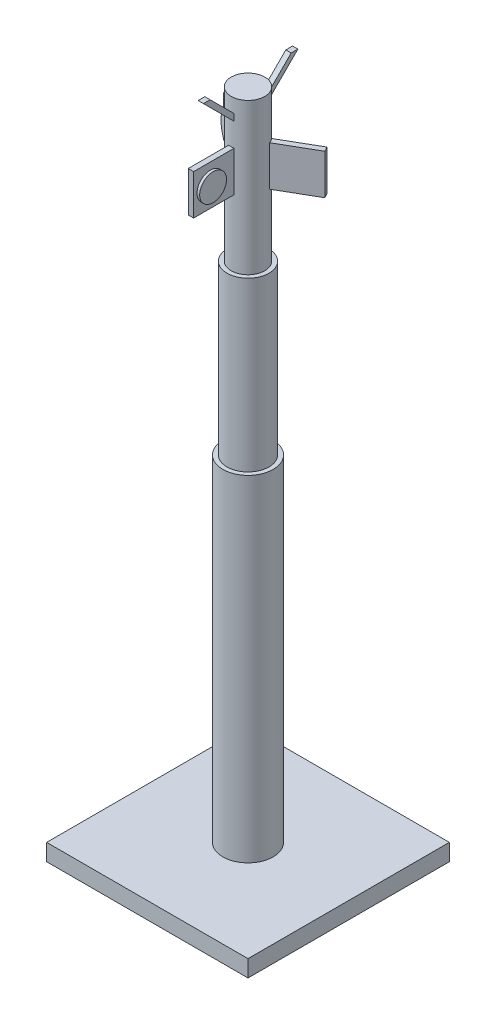
ISO-10303-21;
HEADER;
FILE_DESCRIPTION(('STEP AP214'),'2;1');
FILE_NAME('part.step','',(''),(''),'','','');
FILE_SCHEMA(('AUTOMOTIVE_DESIGN { 1 0 10303 214 1 1 1 1 }'));
ENDSEC;
DATA;
#1=APPLICATION_CONTEXT('core data for automotive mechanical design processes');
#2=APPLICATION_PROTOCOL_DEFINITION('international standard','automotive_design',2000,#1);
#3=PRODUCT_CONTEXT('',#1,'mechanical');
#4=PRODUCT('Part','Part','',(#3));
#5=PRODUCT_RELATED_PRODUCT_CATEGORY('part','',(#4));
#6=PRODUCT_DEFINITION_FORMATION('','',#4);
#7=PRODUCT_DEFINITION_CONTEXT('part definition',#1,'design');
#8=PRODUCT_DEFINITION('design','',#6,#7);
#9=PRODUCT_DEFINITION_SHAPE('','',#8);
#10=(LENGTH_UNIT() NAMED_UNIT(*) SI_UNIT(.MILLI.,.METRE.));
#11=(NAMED_UNIT(*) PLANE_ANGLE_UNIT() SI_UNIT($,.RADIAN.));
#12=(NAMED_UNIT(*) SI_UNIT($,.STERADIAN.) SOLID_ANGLE_UNIT());
#13=UNCERTAINTY_MEASURE_WITH_UNIT(LENGTH_MEASURE(1.E-05),#10,'distance_accuracy_value','');
#14=(GEOMETRIC_REPRESENTATION_CONTEXT(3) GLOBAL_UNCERTAINTY_ASSIGNED_CONTEXT((#13)) GLOBAL_UNIT_ASSIGNED_CONTEXT((#10,
#11,#12)) REPRESENTATION_CONTEXT('',''));
#15=CARTESIAN_POINT('',(0.,0.,0.));
#16=DIRECTION('',(0.,0.,1.));
#17=DIRECTION('',(1.,0.,0.));
#18=AXIS2_PLACEMENT_3D('',#15,#16,#17);
#19=CARTESIAN_POINT('',(-0.8,186.622477316981,0.622477316980994));
#20=DIRECTION('',(0.,0.707106781186553,0.707106781186542));
#21=DIRECTION('',(0.,-0.707106781186542,0.707106781186553));
#22=AXIS2_PLACEMENT_3D('',#19,#20,#21);
#23=PLANE('',#22);
#24=DIRECTION('',(1.,0.,0.));
#25=VECTOR('',#24,1.);
#26=CARTESIAN_POINT('',(-0.8,186.622477316981,0.622477316980994));
#27=LINE('',#26,#25);
#28=CARTESIAN_POINT('',(-0.8,186.622477316981,0.622477316980994));
#29=VERTEX_POINT('',#28);
#30=CARTESIAN_POINT('',(0.8,186.622477316981,0.622477316980994));
#31=VERTEX_POINT('',#30);
#32=EDGE_CURVE('E66',#29,#31,#27,.T.);
#33=ORIENTED_EDGE('',*,*,#32,.T.);
#34=DIRECTION('',(0.,-0.707106781186542,0.707106781186553));
#35=VECTOR('',#34,1.);
#36=CARTESIAN_POINT('',(0.8,186.622477316981,0.622477316980994));
#37=LINE('',#36,#35);
#38=CARTESIAN_POINT('',(0.8,185.622477316981,1.62247731698098));
#39=VERTEX_POINT('',#38);
#40=EDGE_CURVE('E59',#31,#39,#37,.T.);
#41=ORIENTED_EDGE('',*,*,#40,.T.);
#42=DIRECTION('',(1.,0.,0.));
#43=VECTOR('',#42,1.);
#44=CARTESIAN_POINT('',(-0.8,185.622477316981,1.62247731698098));
#45=LINE('',#44,#43);
#46=CARTESIAN_POINT('',(-0.8,185.622477316981,1.62247731698098));
#47=VERTEX_POINT('',#46);
#48=EDGE_CURVE('E74',#47,#39,#45,.T.);
#49=ORIENTED_EDGE('',*,*,#48,.F.);
#50=DIRECTION('',(0.,-0.707106781186542,0.707106781186553));
#51=VECTOR('',#50,1.);
#52=CARTESIAN_POINT('',(-0.8,186.622477316981,0.622477316980994));
#53=LINE('',#52,#51);
#54=EDGE_CURVE('E102',#29,#47,#53,.T.);
#55=ORIENTED_EDGE('',*,*,#54,.F.);
#56=EDGE_LOOP('',(#33,#41,#49,#55));
#57=FACE_BOUND('',#56,.T.);
#58=ADVANCED_FACE('F51',(#57),#23,.F.);
#59=CARTESIAN_POINT('',(-0.8,198.071067811866,14.0710678118654));
#60=DIRECTION('',(0.,-0.707106781186545,0.707106781186551));
#61=DIRECTION('',(0.,-0.707106781186551,-0.707106781186545));
#62=AXIS2_PLACEMENT_3D('',#59,#60,#61);
#63=PLANE('',#62);
#64=ORIENTED_EDGE('',*,*,#48,.T.);
#65=DIRECTION('',(0.,-0.707106781186551,-0.707106781186544));
#66=VECTOR('',#65,1.);
#67=CARTESIAN_POINT('',(0.8,189.,5.));
#68=LINE('',#67,#66);
#69=CARTESIAN_POINT('',(0.8,198.071067811866,14.0710678118654));
#70=VERTEX_POINT('',#69);
#71=EDGE_CURVE('E121',#70,#39,#68,.T.);
#72=ORIENTED_EDGE('',*,*,#71,.F.);
#73=DIRECTION('',(1.,0.,0.));
#74=VECTOR('',#73,1.);
#75=CARTESIAN_POINT('',(-0.8,198.071067811866,14.0710678118654));
#76=LINE('',#75,#74);
#77=CARTESIAN_POINT('',(-0.8,198.071067811866,14.0710678118654));
#78=VERTEX_POINT('',#77);
#79=EDGE_CURVE('E110',#78,#70,#76,.T.);
#80=ORIENTED_EDGE('',*,*,#79,.F.);
#81=DIRECTION('',(0.,-0.707106781186551,-0.707106781186544));
#82=VECTOR('',#81,1.);
#83=CARTESIAN_POINT('',(-0.8,189.,5.));
#84=LINE('',#83,#82);
#85=EDGE_CURVE('E113',#78,#47,#84,.T.);
#86=ORIENTED_EDGE('',*,*,#85,.T.);
#87=EDGE_LOOP('',(#64,#72,#80,#86));
#88=FACE_BOUND('',#87,.T.);
#89=ADVANCED_FACE('F123',(#88),#63,.T.);
#90=CARTESIAN_POINT('',(-0.8,198.071067811866,12.0710678118654));
#91=DIRECTION('',(0.,1.,0.));
#92=DIRECTION('',(0.,0.,1.));
#93=AXIS2_PLACEMENT_3D('',#90,#91,#92);
#94=PLANE('',#93);
#95=ORIENTED_EDGE('',*,*,#79,.T.);
#96=DIRECTION('',(0.,0.,1.));
#97=VECTOR('',#96,1.);
#98=CARTESIAN_POINT('',(0.8,198.071067811866,12.0710678118654));
#99=LINE('',#98,#97);
#100=CARTESIAN_POINT('',(0.8,198.071067811866,12.0710678118654));
#101=VERTEX_POINT('',#100);
#102=EDGE_CURVE('E101',#101,#70,#99,.T.);
#103=ORIENTED_EDGE('',*,*,#102,.F.);
#104=DIRECTION('',(1.,0.,0.));
#105=VECTOR('',#104,1.);
#106=CARTESIAN_POINT('',(-0.8,198.071067811866,12.0710678118654));
#107=LINE('',#106,#105);
#108=CARTESIAN_POINT('',(-0.8,198.071067811866,12.0710678118654));
#109=VERTEX_POINT('',#108);
#110=EDGE_CURVE('E97',#109,#101,#107,.T.);
#111=ORIENTED_EDGE('',*,*,#110,.F.);
#112=DIRECTION('',(0.,0.,1.));
#113=VECTOR('',#112,1.);
#114=CARTESIAN_POINT('',(-0.8,198.071067811866,12.0710678118654));
#115=LINE('',#114,#113);
#116=EDGE_CURVE('E108',#109,#78,#115,.T.);
#117=ORIENTED_EDGE('',*,*,#116,.T.);
#118=EDGE_LOOP('',(#95,#103,#111,#117));
#119=FACE_BOUND('',#118,.T.);
#120=ADVANCED_FACE('F107',(#119),#94,.T.);
#121=CARTESIAN_POINT('',(-0.8,191.,5.));
#122=DIRECTION('',(0.,0.707106781186543,-0.707106781186551));
#123=DIRECTION('',(0.,0.707106781186552,0.707106781186544));
#124=AXIS2_PLACEMENT_3D('',#121,#122,#123);
#125=PLANE('',#124);
#126=ORIENTED_EDGE('',*,*,#110,.T.);
#127=DIRECTION('',(0.,-0.707106781186551,-0.707106781186544));
#128=VECTOR('',#127,1.);
#129=CARTESIAN_POINT('',(0.8,191.,5.));
#130=LINE('',#129,#128);
#131=EDGE_CURVE('E12',#101,#31,#130,.T.);
#132=ORIENTED_EDGE('',*,*,#131,.T.);
#133=ORIENTED_EDGE('',*,*,#32,.F.);
#134=DIRECTION('',(0.,-0.707106781186551,-0.707106781186544));
#135=VECTOR('',#134,1.);
#136=CARTESIAN_POINT('',(-0.8,191.,5.));
#137=LINE('',#136,#135);
#138=EDGE_CURVE('E94',#109,#29,#137,.T.);
#139=ORIENTED_EDGE('',*,*,#138,.F.);
#140=EDGE_LOOP('',(#126,#132,#133,#139));
#141=FACE_BOUND('',#140,.T.);
#142=ADVANCED_FACE('F96',(#141),#125,.T.);
#143=CARTESIAN_POINT('',(-0.8,0.,0.));
#144=DIRECTION('',(-1.,0.,0.));
#145=DIRECTION('',(0.,0.,1.));
#146=AXIS2_PLACEMENT_3D('',#143,#144,#145);
#147=PLANE('',#146);
#148=ORIENTED_EDGE('',*,*,#138,.T.);
#149=ORIENTED_EDGE('',*,*,#54,.T.);
#150=ORIENTED_EDGE('',*,*,#85,.F.);
#151=ORIENTED_EDGE('',*,*,#116,.F.);
#152=EDGE_LOOP('',(#148,#149,#150,#151));
#153=FACE_BOUND('',#152,.T.);
#154=ADVANCED_FACE('F112',(#153),#147,.T.);
#155=CARTESIAN_POINT('',(0.8,0.,0.));
#156=DIRECTION('',(-1.,0.,0.));
#157=DIRECTION('',(0.,0.,1.));
#158=AXIS2_PLACEMENT_3D('',#155,#156,#157);
#159=PLANE('',#158);
#160=ORIENTED_EDGE('',*,*,#131,.F.);
#161=ORIENTED_EDGE('',*,*,#102,.T.);
#162=ORIENTED_EDGE('',*,*,#71,.T.);
#163=ORIENTED_EDGE('',*,*,#40,.F.);
#164=EDGE_LOOP('',(#160,#161,#162,#163));
#165=FACE_BOUND('',#164,.T.);
#166=ADVANCED_FACE('F53',(#165),#159,.F.);
#167=CLOSED_SHELL('',(#58,#89,#120,#142,#154,#166));
#168=MANIFOLD_SOLID_BREP('B2',#167);
#169=CARTESIAN_POINT('',(-0.8,191.,-5.));
#170=DIRECTION('',(0.,-0.707106781186546,-0.707106781186549));
#171=DIRECTION('',(0.,0.707106781186549,-0.707106781186546));
#172=AXIS2_PLACEMENT_3D('',#169,#170,#171);
#173=PLANE('',#172);
#174=DIRECTION('',(1.,0.,0.));
#175=VECTOR('',#174,1.);
#176=CARTESIAN_POINT('',(-0.8,186.622477316981,-0.622477316980986));
#177=LINE('',#176,#175);
#178=CARTESIAN_POINT('',(-0.8,186.622477316981,-0.622477316980986));
#179=VERTEX_POINT('',#178);
#180=CARTESIAN_POINT('',(0.8,186.622477316981,-0.622477316980986));
#181=VERTEX_POINT('',#180);
#182=EDGE_CURVE('E205',#179,#181,#177,.T.);
#183=ORIENTED_EDGE('',*,*,#182,.T.);
#184=DIRECTION('',(0.,-0.70710678118655,0.707106781186545));
#185=VECTOR('',#184,1.);
#186=CARTESIAN_POINT('',(0.8,191.,-5.));
#187=LINE('',#186,#185);
#188=CARTESIAN_POINT('',(0.8,198.071067811866,-12.0710678118655));
#189=VERTEX_POINT('',#188);
#190=EDGE_CURVE('E245',#189,#181,#187,.T.);
#191=ORIENTED_EDGE('',*,*,#190,.F.);
#192=DIRECTION('',(1.,0.,0.));
#193=VECTOR('',#192,1.);
#194=CARTESIAN_POINT('',(-0.8,198.071067811866,-12.0710678118655));
#195=LINE('',#194,#193);
#196=CARTESIAN_POINT('',(-0.8,198.071067811866,-12.0710678118655));
#197=VERTEX_POINT('',#196);
#198=EDGE_CURVE('E49',#197,#189,#195,.T.);
#199=ORIENTED_EDGE('',*,*,#198,.F.);
#200=DIRECTION('',(0.,-0.70710678118655,0.707106781186545));
#201=VECTOR('',#200,1.);
#202=CARTESIAN_POINT('',(-0.8,191.,-5.));
#203=LINE('',#202,#201);
#204=EDGE_CURVE('E218',#197,#179,#203,.T.);
#205=ORIENTED_EDGE('',*,*,#204,.T.);
#206=EDGE_LOOP('',(#183,#191,#199,#205));
#207=FACE_BOUND('',#206,.T.);
#208=ADVANCED_FACE('F201',(#207),#173,.F.);
#209=CARTESIAN_POINT('',(-0.8,198.071067811866,-12.0710678118655));
#210=DIRECTION('',(0.,-1.,0.));
#211=DIRECTION('',(0.,0.,-1.));
#212=AXIS2_PLACEMENT_3D('',#209,#210,#211);
#213=PLANE('',#212);
#214=ORIENTED_EDGE('',*,*,#198,.T.);
#215=DIRECTION('',(0.,0.,-1.));
#216=VECTOR('',#215,1.);
#217=CARTESIAN_POINT('',(0.8,198.071067811866,-12.0710678118655));
#218=LINE('',#217,#216);
#219=CARTESIAN_POINT('',(0.8,198.071067811865,-14.0710678118655));
#220=VERTEX_POINT('',#219);
#221=EDGE_CURVE('E260',#189,#220,#218,.T.);
#222=ORIENTED_EDGE('',*,*,#221,.T.);
#223=DIRECTION('',(1.,0.,0.));
#224=VECTOR('',#223,1.);
#225=CARTESIAN_POINT('',(-0.8,198.071067811865,-14.0710678118655));
#226=LINE('',#225,#224);
#227=CARTESIAN_POINT('',(-0.8,198.071067811865,-14.0710678118655));
#228=VERTEX_POINT('',#227);
#229=EDGE_CURVE('E210',#228,#220,#226,.T.);
#230=ORIENTED_EDGE('',*,*,#229,.F.);
#231=DIRECTION('',(0.,0.,-1.));
#232=VECTOR('',#231,1.);
#233=CARTESIAN_POINT('',(-0.8,198.071067811866,-12.0710678118655));
#234=LINE('',#233,#232);
#235=EDGE_CURVE('E250',#197,#228,#234,.T.);
#236=ORIENTED_EDGE('',*,*,#235,.F.);
#237=EDGE_LOOP('',(#214,#222,#230,#236));
#238=FACE_BOUND('',#237,.T.);
#239=ADVANCED_FACE('F274',(#238),#213,.F.);
#240=CARTESIAN_POINT('',(-0.8,198.071067811865,-14.0710678118655));
#241=DIRECTION('',(0.,0.707106781186548,0.707106781186548));
#242=DIRECTION('',(0.,-0.707106781186548,0.707106781186548));
#243=AXIS2_PLACEMENT_3D('',#240,#241,#242);
#244=PLANE('',#243);
#245=ORIENTED_EDGE('',*,*,#229,.T.);
#246=DIRECTION('',(0.,-0.707106781186558,0.707106781186537));
#247=VECTOR('',#246,1.);
#248=CARTESIAN_POINT('',(0.8,189.,-5.));
#249=LINE('',#248,#247);
#250=CARTESIAN_POINT('',(0.8,185.622477316981,-1.62247731698102));
#251=VERTEX_POINT('',#250);
#252=EDGE_CURVE('E256',#220,#251,#249,.T.);
#253=ORIENTED_EDGE('',*,*,#252,.T.);
#254=DIRECTION('',(1.,0.,0.));
#255=VECTOR('',#254,1.);
#256=CARTESIAN_POINT('',(-0.8,185.622477316981,-1.62247731698102));
#257=LINE('',#256,#255);
#258=CARTESIAN_POINT('',(-0.8,185.622477316981,-1.62247731698102));
#259=VERTEX_POINT('',#258);
#260=EDGE_CURVE('E249',#259,#251,#257,.T.);
#261=ORIENTED_EDGE('',*,*,#260,.F.);
#262=DIRECTION('',(0.,-0.707106781186558,0.707106781186537));
#263=VECTOR('',#262,1.);
#264=CARTESIAN_POINT('',(-0.8,189.,-5.));
#265=LINE('',#264,#263);
#266=EDGE_CURVE('E226',#228,#259,#265,.T.);
#267=ORIENTED_EDGE('',*,*,#266,.F.);
#268=EDGE_LOOP('',(#245,#253,#261,#267));
#269=FACE_BOUND('',#268,.T.);
#270=ADVANCED_FACE('F271',(#269),#244,.F.);
#271=CARTESIAN_POINT('',(-0.8,186.622477316981,-0.622477316980986));
#272=DIRECTION('',(0.,-0.707106781186549,0.707106781186546));
#273=DIRECTION('',(0.,-0.707106781186546,-0.707106781186549));
#274=AXIS2_PLACEMENT_3D('',#271,#272,#273);
#275=PLANE('',#274);
#276=ORIENTED_EDGE('',*,*,#260,.T.);
#277=DIRECTION('',(0.,-0.707106781186546,-0.707106781186549));
#278=VECTOR('',#277,1.);
#279=CARTESIAN_POINT('',(0.8,186.622477316981,-0.622477316980986));
#280=LINE('',#279,#278);
#281=EDGE_CURVE('E252',#181,#251,#280,.T.);
#282=ORIENTED_EDGE('',*,*,#281,.F.);
#283=ORIENTED_EDGE('',*,*,#182,.F.);
#284=DIRECTION('',(0.,-0.707106781186546,-0.707106781186549));
#285=VECTOR('',#284,1.);
#286=CARTESIAN_POINT('',(-0.8,186.622477316981,-0.622477316980986));
#287=LINE('',#286,#285);
#288=EDGE_CURVE('E266',#179,#259,#287,.T.);
#289=ORIENTED_EDGE('',*,*,#288,.T.);
#290=EDGE_LOOP('',(#276,#282,#283,#289));
#291=FACE_BOUND('',#290,.T.);
#292=ADVANCED_FACE('F203',(#291),#275,.T.);
#293=CARTESIAN_POINT('',(-0.8,0.,0.));
#294=DIRECTION('',(1.,0.,0.));
#295=DIRECTION('',(0.,0.,-1.));
#296=AXIS2_PLACEMENT_3D('',#293,#294,#295);
#297=PLANE('',#296);
#298=ORIENTED_EDGE('',*,*,#204,.F.);
#299=ORIENTED_EDGE('',*,*,#235,.T.);
#300=ORIENTED_EDGE('',*,*,#266,.T.);
#301=ORIENTED_EDGE('',*,*,#288,.F.);
#302=EDGE_LOOP('',(#298,#299,#300,#301));
#303=FACE_BOUND('',#302,.T.);
#304=ADVANCED_FACE('F275',(#303),#297,.F.);
#305=CARTESIAN_POINT('',(0.8,0.,0.));
#306=DIRECTION('',(1.,0.,0.));
#307=DIRECTION('',(0.,0.,-1.));
#308=AXIS2_PLACEMENT_3D('',#305,#306,#307);
#309=PLANE('',#308);
#310=ORIENTED_EDGE('',*,*,#190,.T.);
#311=ORIENTED_EDGE('',*,*,#281,.T.);
#312=ORIENTED_EDGE('',*,*,#252,.F.);
#313=ORIENTED_EDGE('',*,*,#221,.F.);
#314=EDGE_LOOP('',(#310,#311,#312,#313));
#315=FACE_BOUND('',#314,.T.);
#316=ADVANCED_FACE('F258',(#315),#309,.T.);
#317=CLOSED_SHELL('',(#208,#239,#270,#292,#304,#316));
#318=MANIFOLD_SOLID_BREP('B6',#317);
#319=CARTESIAN_POINT('',(0.,100.,0.));
#320=DIRECTION('',(0.,-1.,0.));
#321=DIRECTION('',(0.,0.,-1.));
#322=AXIS2_PLACEMENT_3D('',#319,#320,#321);
#323=CYLINDRICAL_SURFACE('',#322,7.5);
#324=CARTESIAN_POINT('',(0.,100.,0.));
#325=DIRECTION('',(0.,1.,0.));
#326=DIRECTION('',(0.,0.,1.));
#327=AXIS2_PLACEMENT_3D('',#324,#325,#326);
#328=CIRCLE('',#327,7.5);
#329=CARTESIAN_POINT('',(0.,100.,7.5));
#330=VERTEX_POINT('',#329);
#331=EDGE_CURVE('E574',#330,#330,#328,.T.);
#332=ORIENTED_EDGE('',*,*,#331,.F.);
#333=EDGE_LOOP('',(#332));
#334=FACE_BOUND('',#333,.T.);
#335=CARTESIAN_POINT('',(0.,0.,0.));
#336=DIRECTION('',(0.,1.,0.));
#337=DIRECTION('',(0.,0.,1.));
#338=AXIS2_PLACEMENT_3D('',#335,#336,#337);
#339=CIRCLE('',#338,7.5);
#340=CARTESIAN_POINT('',(0.,0.,7.5));
#341=VERTEX_POINT('',#340);
#342=EDGE_CURVE('E570',#341,#341,#339,.T.);
#343=ORIENTED_EDGE('',*,*,#342,.T.);
#344=EDGE_LOOP('',(#343));
#345=FACE_BOUND('',#344,.T.);
#346=ADVANCED_FACE('F342',(#334,#345),#323,.T.);
#347=CARTESIAN_POINT('',(0.,100.,0.));
#348=DIRECTION('',(0.,1.,0.));
#349=DIRECTION('',(0.,0.,1.));
#350=AXIS2_PLACEMENT_3D('',#347,#348,#349);
#351=PLANE('',#350);
#352=CARTESIAN_POINT('',(0.,100.,0.));
#353=DIRECTION('',(0.,1.,0.));
#354=DIRECTION('',(0.,0.,1.));
#355=AXIS2_PLACEMENT_3D('',#352,#353,#354);
#356=CIRCLE('',#355,6.25);
#357=CARTESIAN_POINT('',(0.,100.,6.25));
#358=VERTEX_POINT('',#357);
#359=EDGE_CURVE('E540',#358,#358,#356,.T.);
#360=ORIENTED_EDGE('',*,*,#359,.F.);
#361=EDGE_LOOP('',(#360));
#362=FACE_BOUND('',#361,.T.);
#363=ORIENTED_EDGE('',*,*,#331,.T.);
#364=EDGE_LOOP('',(#363));
#365=FACE_BOUND('',#364,.T.);
#366=ADVANCED_FACE('F645',(#362,#365),#351,.T.);
#367=CARTESIAN_POINT('',(0.,150.,0.));
#368=DIRECTION('',(0.,-1.,0.));
#369=DIRECTION('',(0.,0.,-1.));
#370=AXIS2_PLACEMENT_3D('',#367,#368,#369);
#371=CYLINDRICAL_SURFACE('',#370,6.25);
#372=CARTESIAN_POINT('',(0.,150.,0.));
#373=DIRECTION('',(0.,1.,0.));
#374=DIRECTION('',(0.,0.,1.));
#375=AXIS2_PLACEMENT_3D('',#372,#373,#374);
#376=CIRCLE('',#375,6.25);
#377=CARTESIAN_POINT('',(0.,150.,6.25));
#378=VERTEX_POINT('',#377);
#379=EDGE_CURVE('E571',#378,#378,#376,.T.);
#380=ORIENTED_EDGE('',*,*,#379,.F.);
#381=EDGE_LOOP('',(#380));
#382=FACE_BOUND('',#381,.T.);
#383=ORIENTED_EDGE('',*,*,#359,.T.);
#384=EDGE_LOOP('',(#383));
#385=FACE_BOUND('',#384,.T.);
#386=ADVANCED_FACE('F650',(#382,#385),#371,.T.);
#387=CARTESIAN_POINT('',(0.,150.,0.));
#388=DIRECTION('',(0.,1.,0.));
#389=DIRECTION('',(0.,0.,1.));
#390=AXIS2_PLACEMENT_3D('',#387,#388,#389);
#391=PLANE('',#390);
#392=CARTESIAN_POINT('',(0.,150.,0.));
#393=DIRECTION('',(0.,1.,0.));
#394=DIRECTION('',(0.,0.,1.));
#395=AXIS2_PLACEMENT_3D('',#392,#393,#394);
#396=CIRCLE('',#395,5.);
#397=CARTESIAN_POINT('',(0.,150.,5.));
#398=VERTEX_POINT('',#397);
#399=EDGE_CURVE('E536',#398,#398,#396,.T.);
#400=ORIENTED_EDGE('',*,*,#399,.F.);
#401=EDGE_LOOP('',(#400));
#402=FACE_BOUND('',#401,.T.);
#403=ORIENTED_EDGE('',*,*,#379,.T.);
#404=EDGE_LOOP('',(#403));
#405=FACE_BOUND('',#404,.T.);
#406=ADVANCED_FACE('F695',(#402,#405),#391,.T.);
#407=CARTESIAN_POINT('',(30.,-5.,30.));
#408=DIRECTION('',(-1.,0.,0.));
#409=DIRECTION('',(0.,0.,1.));
#410=AXIS2_PLACEMENT_3D('',#407,#408,#409);
#411=PLANE('',#410);
#412=DIRECTION('',(0.,0.,1.));
#413=VECTOR('',#412,1.);
#414=CARTESIAN_POINT('',(30.,0.,30.));
#415=LINE('',#414,#413);
#416=CARTESIAN_POINT('',(30.,0.,-30.));
#417=VERTEX_POINT('',#416);
#418=CARTESIAN_POINT('',(30.,0.,30.));
#419=VERTEX_POINT('',#418);
#420=EDGE_CURVE('E535',#417,#419,#415,.T.);
#421=ORIENTED_EDGE('',*,*,#420,.T.);
#422=DIRECTION('',(0.,1.,0.));
#423=VECTOR('',#422,1.);
#424=CARTESIAN_POINT('',(30.,-5.,30.));
#425=LINE('',#424,#423);
#426=CARTESIAN_POINT('',(30.,-5.,30.));
#427=VERTEX_POINT('',#426);
#428=EDGE_CURVE('E567',#427,#419,#425,.T.);
#429=ORIENTED_EDGE('',*,*,#428,.F.);
#430=DIRECTION('',(0.,0.,1.));
#431=VECTOR('',#430,1.);
#432=CARTESIAN_POINT('',(30.,-5.,30.));
#433=LINE('',#432,#431);
#434=CARTESIAN_POINT('',(30.,-5.,-30.));
#435=VERTEX_POINT('',#434);
#436=EDGE_CURVE('E541',#435,#427,#433,.T.);
#437=ORIENTED_EDGE('',*,*,#436,.F.);
#438=DIRECTION('',(0.,1.,0.));
#439=VECTOR('',#438,1.);
#440=CARTESIAN_POINT('',(30.,-5.,-30.));
#441=LINE('',#440,#439);
#442=EDGE_CURVE('E551',#435,#417,#441,.T.);
#443=ORIENTED_EDGE('',*,*,#442,.T.);
#444=EDGE_LOOP('',(#421,#429,#437,#443));
#445=FACE_BOUND('',#444,.T.);
#446=ADVANCED_FACE('F666',(#445),#411,.F.);
#447=CARTESIAN_POINT('',(-30.,-5.,30.));
#448=DIRECTION('',(0.,0.,-1.));
#449=DIRECTION('',(-1.,0.,0.));
#450=AXIS2_PLACEMENT_3D('',#447,#448,#449);
#451=PLANE('',#450);
#452=DIRECTION('',(-1.,0.,0.));
#453=VECTOR('',#452,1.);
#454=CARTESIAN_POINT('',(-30.,0.,30.));
#455=LINE('',#454,#453);
#456=CARTESIAN_POINT('',(-30.,0.,30.));
#457=VERTEX_POINT('',#456);
#458=EDGE_CURVE('E554',#419,#457,#455,.T.);
#459=ORIENTED_EDGE('',*,*,#458,.T.);
#460=DIRECTION('',(0.,1.,0.));
#461=VECTOR('',#460,1.);
#462=CARTESIAN_POINT('',(-30.,-5.,30.));
#463=LINE('',#462,#461);
#464=CARTESIAN_POINT('',(-30.,-5.,30.));
#465=VERTEX_POINT('',#464);
#466=EDGE_CURVE('E564',#465,#457,#463,.T.);
#467=ORIENTED_EDGE('',*,*,#466,.F.);
#468=DIRECTION('',(-1.,0.,0.));
#469=VECTOR('',#468,1.);
#470=CARTESIAN_POINT('',(-30.,-5.,30.));
#471=LINE('',#470,#469);
#472=EDGE_CURVE('E544',#427,#465,#471,.T.);
#473=ORIENTED_EDGE('',*,*,#472,.F.);
#474=ORIENTED_EDGE('',*,*,#428,.T.);
#475=EDGE_LOOP('',(#459,#467,#473,#474));
#476=FACE_BOUND('',#475,.T.);
#477=ADVANCED_FACE('F678',(#476),#451,.F.);
#478=CARTESIAN_POINT('',(-30.,-5.,30.));
#479=DIRECTION('',(1.,0.,0.));
#480=DIRECTION('',(0.,0.,-1.));
#481=AXIS2_PLACEMENT_3D('',#478,#479,#480);
#482=PLANE('',#481);
#483=DIRECTION('',(0.,0.,-1.));
#484=VECTOR('',#483,1.);
#485=CARTESIAN_POINT('',(-30.,0.,30.));
#486=LINE('',#485,#484);
#487=CARTESIAN_POINT('',(-30.,0.,-30.));
#488=VERTEX_POINT('',#487);
#489=EDGE_CURVE('E556',#457,#488,#486,.T.);
#490=ORIENTED_EDGE('',*,*,#489,.T.);
#491=DIRECTION('',(0.,1.,0.));
#492=VECTOR('',#491,1.);
#493=CARTESIAN_POINT('',(-30.,-5.,-30.));
#494=LINE('',#493,#492);
#495=CARTESIAN_POINT('',(-30.,-5.,-30.));
#496=VERTEX_POINT('',#495);
#497=EDGE_CURVE('E561',#496,#488,#494,.T.);
#498=ORIENTED_EDGE('',*,*,#497,.F.);
#499=DIRECTION('',(0.,0.,-1.));
#500=VECTOR('',#499,1.);
#501=CARTESIAN_POINT('',(-30.,-5.,30.));
#502=LINE('',#501,#500);
#503=EDGE_CURVE('E547',#465,#496,#502,.T.);
#504=ORIENTED_EDGE('',*,*,#503,.F.);
#505=ORIENTED_EDGE('',*,*,#466,.T.);
#506=EDGE_LOOP('',(#490,#498,#504,#505));
#507=FACE_BOUND('',#506,.T.);
#508=ADVANCED_FACE('F675',(#507),#482,.F.);
#509=CARTESIAN_POINT('',(-30.,-5.,-30.));
#510=DIRECTION('',(0.,0.,1.));
#511=DIRECTION('',(1.,0.,0.));
#512=AXIS2_PLACEMENT_3D('',#509,#510,#511);
#513=PLANE('',#512);
#514=DIRECTION('',(1.,0.,0.));
#515=VECTOR('',#514,1.);
#516=CARTESIAN_POINT('',(-30.,0.,-30.));
#517=LINE('',#516,#515);
#518=EDGE_CURVE('E545',#488,#417,#517,.T.);
#519=ORIENTED_EDGE('',*,*,#518,.T.);
#520=ORIENTED_EDGE('',*,*,#442,.F.);
#521=DIRECTION('',(1.,0.,0.));
#522=VECTOR('',#521,1.);
#523=CARTESIAN_POINT('',(-30.,-5.,-30.));
#524=LINE('',#523,#522);
#525=EDGE_CURVE('E549',#496,#435,#524,.T.);
#526=ORIENTED_EDGE('',*,*,#525,.F.);
#527=ORIENTED_EDGE('',*,*,#497,.T.);
#528=EDGE_LOOP('',(#519,#520,#526,#527));
#529=FACE_BOUND('',#528,.T.);
#530=ADVANCED_FACE('F671',(#529),#513,.F.);
#531=CARTESIAN_POINT('',(0.,-5.,0.));
#532=DIRECTION('',(0.,-1.,0.));
#533=DIRECTION('',(0.,0.,-1.));
#534=AXIS2_PLACEMENT_3D('',#531,#532,#533);
#535=PLANE('',#534);
#536=ORIENTED_EDGE('',*,*,#436,.T.);
#537=ORIENTED_EDGE('',*,*,#472,.T.);
#538=ORIENTED_EDGE('',*,*,#503,.T.);
#539=ORIENTED_EDGE('',*,*,#525,.T.);
#540=EDGE_LOOP('',(#536,#537,#538,#539));
#541=FACE_BOUND('',#540,.T.);
#542=ADVANCED_FACE('F659',(#541),#535,.T.);
#543=CARTESIAN_POINT('',(0.,0.,0.));
#544=DIRECTION('',(0.,-1.,0.));
#545=DIRECTION('',(0.,0.,-1.));
#546=AXIS2_PLACEMENT_3D('',#543,#544,#545);
#547=PLANE('',#546);
#548=ORIENTED_EDGE('',*,*,#342,.F.);
#549=EDGE_LOOP('',(#548));
#550=FACE_BOUND('',#549,.T.);
#551=ORIENTED_EDGE('',*,*,#420,.F.);
#552=ORIENTED_EDGE('',*,*,#518,.F.);
#553=ORIENTED_EDGE('',*,*,#489,.F.);
#554=ORIENTED_EDGE('',*,*,#458,.F.);
#555=EDGE_LOOP('',(#551,#552,#553,#554));
#556=FACE_BOUND('',#555,.T.);
#557=ADVANCED_FACE('F656',(#550,#556),#547,.F.);
#558=CARTESIAN_POINT('',(0.,195.,0.));
#559=DIRECTION('',(0.,-1.,0.));
#560=DIRECTION('',(0.,0.,-1.));
#561=AXIS2_PLACEMENT_3D('',#558,#559,#560);
#562=CYLINDRICAL_SURFACE('',#561,5.);
#563=CARTESIAN_POINT('',(0.,170.,0.));
#564=DIRECTION('',(0.,-1.,0.));
#565=DIRECTION('',(0.,0.,-1.));
#566=AXIS2_PLACEMENT_3D('',#563,#564,#565);
#567=CIRCLE('',#566,5.);
#568=CARTESIAN_POINT('',(-4.67434205463252,170.,-1.77497221282302));
#569=VERTEX_POINT('',#568);
#570=CARTESIAN_POINT('',(-3.87434205463253,170.,-3.16061285887813));
#571=VERTEX_POINT('',#570);
#572=EDGE_CURVE('E356',#569,#571,#567,.T.);
#573=ORIENTED_EDGE('',*,*,#572,.T.);
#574=DIRECTION('',(0.,-1.,0.));
#575=VECTOR('',#574,1.);
#576=CARTESIAN_POINT('',(-3.87434205463253,195.,-3.16061285887813));
#577=LINE('',#576,#575);
#578=CARTESIAN_POINT('',(-3.87434205463253,182.,-3.16061285887813));
#579=VERTEX_POINT('',#578);
#580=EDGE_CURVE('E360',#571,#579,#577,.F.);
#581=ORIENTED_EDGE('',*,*,#580,.T.);
#582=CARTESIAN_POINT('',(0.,182.,0.));
#583=DIRECTION('',(0.,1.,0.));
#584=DIRECTION('',(0.,0.,1.));
#585=AXIS2_PLACEMENT_3D('',#582,#583,#584);
#586=CIRCLE('',#585,5.);
#587=CARTESIAN_POINT('',(-4.67434205463252,182.,-1.77497221282302));
#588=VERTEX_POINT('',#587);
#589=EDGE_CURVE('E602',#579,#588,#586,.T.);
#590=ORIENTED_EDGE('',*,*,#589,.T.);
#591=DIRECTION('',(0.,-1.,0.));
#592=VECTOR('',#591,1.);
#593=CARTESIAN_POINT('',(-4.67434205463252,195.,-1.77497221282302));
#594=LINE('',#593,#592);
#595=EDGE_CURVE('E460',#569,#588,#594,.F.);
#596=ORIENTED_EDGE('',*,*,#595,.F.);
#597=EDGE_LOOP('',(#573,#581,#590,#596));
#598=FACE_BOUND('',#597,.T.);
#599=CARTESIAN_POINT('',(0.,170.,0.));
#600=DIRECTION('',(0.,-1.,0.));
#601=DIRECTION('',(0.,0.,-1.));
#602=AXIS2_PLACEMENT_3D('',#599,#600,#601);
#603=CIRCLE('',#602,5.);
#604=CARTESIAN_POINT('',(3.87434205463249,170.,-3.16061285887818));
#605=VERTEX_POINT('',#604);
#606=CARTESIAN_POINT('',(4.6743420546325,170.,-1.77497221282308));
#607=VERTEX_POINT('',#606);
#608=EDGE_CURVE('E597',#605,#607,#603,.T.);
#609=ORIENTED_EDGE('',*,*,#608,.T.);
#610=DIRECTION('',(0.,-1.,0.));
#611=VECTOR('',#610,1.);
#612=CARTESIAN_POINT('',(4.67434205463249,195.,-1.77497221282308));
#613=LINE('',#612,#611);
#614=CARTESIAN_POINT('',(4.6743420546325,182.,-1.77497221282308));
#615=VERTEX_POINT('',#614);
#616=EDGE_CURVE('E599',#607,#615,#613,.F.);
#617=ORIENTED_EDGE('',*,*,#616,.T.);
#618=CARTESIAN_POINT('',(0.,182.,0.));
#619=DIRECTION('',(0.,1.,0.));
#620=DIRECTION('',(0.,0.,1.));
#621=AXIS2_PLACEMENT_3D('',#618,#619,#620);
#622=CIRCLE('',#621,5.);
#623=CARTESIAN_POINT('',(3.87434205463249,182.,-3.16061285887818));
#624=VERTEX_POINT('',#623);
#625=EDGE_CURVE('E595',#615,#624,#622,.T.);
#626=ORIENTED_EDGE('',*,*,#625,.T.);
#627=DIRECTION('',(0.,-1.,0.));
#628=VECTOR('',#627,1.);
#629=CARTESIAN_POINT('',(3.87434205463249,195.,-3.16061285887818));
#630=LINE('',#629,#628);
#631=EDGE_CURVE('E592',#605,#624,#630,.F.);
#632=ORIENTED_EDGE('',*,*,#631,.F.);
#633=EDGE_LOOP('',(#609,#617,#626,#632));
#634=FACE_BOUND('',#633,.T.);
#635=CARTESIAN_POINT('',(0.,170.,0.));
#636=DIRECTION('',(0.,-1.,0.));
#637=DIRECTION('',(0.,0.,-1.));
#638=AXIS2_PLACEMENT_3D('',#635,#636,#637);
#639=CIRCLE('',#638,5.);
#640=CARTESIAN_POINT('',(0.8,170.,4.93558507170123));
#641=VERTEX_POINT('',#640);
#642=CARTESIAN_POINT('',(-0.8,170.,4.93558507170123));
#643=VERTEX_POINT('',#642);
#644=EDGE_CURVE('E585',#641,#643,#639,.T.);
#645=ORIENTED_EDGE('',*,*,#644,.T.);
#646=DIRECTION('',(0.,-1.,0.));
#647=VECTOR('',#646,1.);
#648=CARTESIAN_POINT('',(-0.8,195.,4.93558507170123));
#649=LINE('',#648,#647);
#650=CARTESIAN_POINT('',(-0.8,182.,4.93558507170123));
#651=VERTEX_POINT('',#650);
#652=EDGE_CURVE('E587',#643,#651,#649,.F.);
#653=ORIENTED_EDGE('',*,*,#652,.T.);
#654=CARTESIAN_POINT('',(0.,182.,0.));
#655=DIRECTION('',(0.,1.,0.));
#656=DIRECTION('',(0.,0.,1.));
#657=AXIS2_PLACEMENT_3D('',#654,#655,#656);
#658=CIRCLE('',#657,5.);
#659=CARTESIAN_POINT('',(0.8,182.,4.93558507170123));
#660=VERTEX_POINT('',#659);
#661=EDGE_CURVE('E583',#651,#660,#658,.T.);
#662=ORIENTED_EDGE('',*,*,#661,.T.);
#663=DIRECTION('',(0.,-1.,0.));
#664=VECTOR('',#663,1.);
#665=CARTESIAN_POINT('',(0.8,195.,4.93558507170123));
#666=LINE('',#665,#664);
#667=EDGE_CURVE('E539',#641,#660,#666,.F.);
#668=ORIENTED_EDGE('',*,*,#667,.F.);
#669=EDGE_LOOP('',(#645,#653,#662,#668));
#670=FACE_BOUND('',#669,.T.);
#671=CARTESIAN_POINT('',(0.,195.,0.));
#672=DIRECTION('',(0.,1.,0.));
#673=DIRECTION('',(0.,0.,1.));
#674=AXIS2_PLACEMENT_3D('',#671,#672,#673);
#675=CIRCLE('',#674,5.);
#676=CARTESIAN_POINT('',(0.,195.,5.));
#677=VERTEX_POINT('',#676);
#678=EDGE_CURVE('E530',#677,#677,#675,.T.);
#679=ORIENTED_EDGE('',*,*,#678,.F.);
#680=EDGE_LOOP('',(#679));
#681=FACE_BOUND('',#680,.T.);
#682=ORIENTED_EDGE('',*,*,#399,.T.);
#683=EDGE_LOOP('',(#682));
#684=FACE_BOUND('',#683,.T.);
#685=ADVANCED_FACE('F624',(#598,#634,#670,#681,#684),#562,.T.);
#686=CARTESIAN_POINT('',(0.,195.,0.));
#687=DIRECTION('',(0.,1.,0.));
#688=DIRECTION('',(0.,0.,1.));
#689=AXIS2_PLACEMENT_3D('',#686,#687,#688);
#690=PLANE('',#689);
#691=ORIENTED_EDGE('',*,*,#678,.T.);
#692=EDGE_LOOP('',(#691));
#693=FACE_BOUND('',#692,.T.);
#694=ADVANCED_FACE('F753',(#693),#690,.T.);
#695=CARTESIAN_POINT('',(-0.8,0.,0.));
#696=DIRECTION('',(-1.,0.,0.));
#697=DIRECTION('',(0.,0.,1.));
#698=AXIS2_PLACEMENT_3D('',#695,#696,#697);
#699=PLANE('',#698);
#700=ORIENTED_EDGE('',*,*,#652,.F.);
#701=DIRECTION('',(0.,0.,-1.));
#702=VECTOR('',#701,1.);
#703=CARTESIAN_POINT('',(-0.8,170.,17.));
#704=LINE('',#703,#702);
#705=CARTESIAN_POINT('',(-0.8,170.,17.));
#706=VERTEX_POINT('',#705);
#707=EDGE_CURVE('E524',#706,#643,#704,.T.);
#708=ORIENTED_EDGE('',*,*,#707,.F.);
#709=DIRECTION('',(0.,-1.,0.));
#710=VECTOR('',#709,1.);
#711=CARTESIAN_POINT('',(-0.8,182.,17.));
#712=LINE('',#711,#710);
#713=CARTESIAN_POINT('',(-0.8,182.,17.));
#714=VERTEX_POINT('',#713);
#715=EDGE_CURVE('E521',#714,#706,#712,.T.);
#716=ORIENTED_EDGE('',*,*,#715,.F.);
#717=DIRECTION('',(0.,0.,1.));
#718=VECTOR('',#717,1.);
#719=CARTESIAN_POINT('',(-0.8,182.,5.));
#720=LINE('',#719,#718);
#721=EDGE_CURVE('E519',#651,#714,#720,.T.);
#722=ORIENTED_EDGE('',*,*,#721,.F.);
#723=EDGE_LOOP('',(#700,#708,#716,#722));
#724=FACE_BOUND('',#723,.T.);
#725=ADVANCED_FACE('F759',(#724),#699,.T.);
#726=CARTESIAN_POINT('',(0.8,0.,0.));
#727=DIRECTION('',(-1.,0.,0.));
#728=DIRECTION('',(0.,0.,1.));
#729=AXIS2_PLACEMENT_3D('',#726,#727,#728);
#730=PLANE('',#729);
#731=CARTESIAN_POINT('',(0.8,175.874664873234,12.));
#732=DIRECTION('',(-1.,0.,0.));
#733=DIRECTION('',(0.,0.,1.));
#734=AXIS2_PLACEMENT_3D('',#731,#732,#733);
#735=CIRCLE('',#734,4.);
#736=CARTESIAN_POINT('',(0.8,175.874664873234,16.));
#737=VERTEX_POINT('',#736);
#738=EDGE_CURVE('E589',#737,#737,#735,.F.);
#739=ORIENTED_EDGE('',*,*,#738,.F.);
#740=EDGE_LOOP('',(#739));
#741=FACE_BOUND('',#740,.T.);
#742=DIRECTION('',(0.,0.,-1.));
#743=VECTOR('',#742,1.);
#744=CARTESIAN_POINT('',(0.8,170.,17.));
#745=LINE('',#744,#743);
#746=CARTESIAN_POINT('',(0.8,170.,17.));
#747=VERTEX_POINT('',#746);
#748=EDGE_CURVE('E516',#747,#641,#745,.T.);
#749=ORIENTED_EDGE('',*,*,#748,.T.);
#750=ORIENTED_EDGE('',*,*,#667,.T.);
#751=DIRECTION('',(0.,0.,1.));
#752=VECTOR('',#751,1.);
#753=CARTESIAN_POINT('',(0.8,182.,5.));
#754=LINE('',#753,#752);
#755=CARTESIAN_POINT('',(0.8,182.,17.));
#756=VERTEX_POINT('',#755);
#757=EDGE_CURVE('E511',#660,#756,#754,.T.);
#758=ORIENTED_EDGE('',*,*,#757,.T.);
#759=DIRECTION('',(0.,-1.,0.));
#760=VECTOR('',#759,1.);
#761=CARTESIAN_POINT('',(0.8,182.,17.));
#762=LINE('',#761,#760);
#763=EDGE_CURVE('E513',#756,#747,#762,.T.);
#764=ORIENTED_EDGE('',*,*,#763,.T.);
#765=EDGE_LOOP('',(#749,#750,#758,#764));
#766=FACE_BOUND('',#765,.T.);
#767=ADVANCED_FACE('F766',(#741,#766),#730,.F.);
#768=CARTESIAN_POINT('',(-0.8,170.,2.5));
#769=DIRECTION('',(0.,-1.,0.));
#770=DIRECTION('',(0.,0.,-1.));
#771=AXIS2_PLACEMENT_3D('',#768,#769,#770);
#772=PLANE('',#771);
#773=ORIENTED_EDGE('',*,*,#644,.F.);
#774=ORIENTED_EDGE('',*,*,#748,.F.);
#775=DIRECTION('',(1.,0.,0.));
#776=VECTOR('',#775,1.);
#777=CARTESIAN_POINT('',(-0.8,170.,17.));
#778=LINE('',#777,#776);
#779=EDGE_CURVE('E528',#706,#747,#778,.T.);
#780=ORIENTED_EDGE('',*,*,#779,.F.);
#781=ORIENTED_EDGE('',*,*,#707,.T.);
#782=EDGE_LOOP('',(#773,#774,#780,#781));
#783=FACE_BOUND('',#782,.T.);
#784=ADVANCED_FACE('F775',(#783),#772,.T.);
#785=CARTESIAN_POINT('',(-0.8,182.,17.));
#786=DIRECTION('',(0.,0.,1.));
#787=DIRECTION('',(0.,-1.,0.));
#788=AXIS2_PLACEMENT_3D('',#785,#786,#787);
#789=PLANE('',#788);
#790=ORIENTED_EDGE('',*,*,#779,.T.);
#791=ORIENTED_EDGE('',*,*,#763,.F.);
#792=DIRECTION('',(1.,0.,0.));
#793=VECTOR('',#792,1.);
#794=CARTESIAN_POINT('',(-0.8,182.,17.));
#795=LINE('',#794,#793);
#796=EDGE_CURVE('E527',#714,#756,#795,.T.);
#797=ORIENTED_EDGE('',*,*,#796,.F.);
#798=ORIENTED_EDGE('',*,*,#715,.T.);
#799=EDGE_LOOP('',(#790,#791,#797,#798));
#800=FACE_BOUND('',#799,.T.);
#801=ADVANCED_FACE('F784',(#800),#789,.T.);
#802=CARTESIAN_POINT('',(-0.8,182.,5.));
#803=DIRECTION('',(0.,1.,0.));
#804=DIRECTION('',(0.,0.,1.));
#805=AXIS2_PLACEMENT_3D('',#802,#803,#804);
#806=PLANE('',#805);
#807=ORIENTED_EDGE('',*,*,#661,.F.);
#808=ORIENTED_EDGE('',*,*,#721,.T.);
#809=ORIENTED_EDGE('',*,*,#796,.T.);
#810=ORIENTED_EDGE('',*,*,#757,.F.);
#811=EDGE_LOOP('',(#807,#808,#809,#810));
#812=FACE_BOUND('',#811,.T.);
#813=ADVANCED_FACE('F792',(#812),#806,.T.);
#814=CARTESIAN_POINT('',(1.6,175.874664873234,12.));
#815=DIRECTION('',(-1.,0.,0.));
#816=DIRECTION('',(0.,0.,1.));
#817=AXIS2_PLACEMENT_3D('',#814,#815,#816);
#818=CYLINDRICAL_SURFACE('',#817,4.);
#819=CARTESIAN_POINT('',(1.6,175.874664873234,12.));
#820=DIRECTION('',(1.,0.,0.));
#821=DIRECTION('',(0.,0.,-1.));
#822=AXIS2_PLACEMENT_3D('',#819,#820,#821);
#823=CIRCLE('',#822,4.);
#824=CARTESIAN_POINT('',(1.6,175.874664873234,8.));
#825=VERTEX_POINT('',#824);
#826=EDGE_CURVE('E506',#825,#825,#823,.T.);
#827=ORIENTED_EDGE('',*,*,#826,.F.);
#828=EDGE_LOOP('',(#827));
#829=FACE_BOUND('',#828,.T.);
#830=ORIENTED_EDGE('',*,*,#738,.T.);
#831=EDGE_LOOP('',(#830));
#832=FACE_BOUND('',#831,.T.);
#833=ADVANCED_FACE('F799',(#829,#832),#818,.T.);
#834=CARTESIAN_POINT('',(1.6,175.874664873234,12.));
#835=DIRECTION('',(1.,0.,0.));
#836=DIRECTION('',(0.,0.,-1.));
#837=AXIS2_PLACEMENT_3D('',#834,#835,#836);
#838=PLANE('',#837);
#839=ORIENTED_EDGE('',*,*,#826,.T.);
#840=EDGE_LOOP('',(#839));
#841=FACE_BOUND('',#840,.T.);
#842=ADVANCED_FACE('F806',(#841),#838,.T.);
#843=CARTESIAN_POINT('',(0.400000000000003,0.,0.692820323027549));
#844=DIRECTION('',(0.500000000000004,0.,0.866025403784436));
#845=DIRECTION('',(0.866025403784436,0.,-0.500000000000004));
#846=AXIS2_PLACEMENT_3D('',#843,#844,#845);
#847=PLANE('',#846);
#848=ORIENTED_EDGE('',*,*,#616,.F.);
#849=DIRECTION('',(-0.866025403784436,0.,0.500000000000004));
#850=VECTOR('',#849,1.);
#851=CARTESIAN_POINT('',(15.1224318643354,170.,-7.80717967697252));
#852=LINE('',#851,#850);
#853=CARTESIAN_POINT('',(15.1224318643354,170.,-7.80717967697252));
#854=VERTEX_POINT('',#853);
#855=EDGE_CURVE('E500',#854,#607,#852,.T.);
#856=ORIENTED_EDGE('',*,*,#855,.F.);
#857=DIRECTION('',(0.,-1.,0.));
#858=VECTOR('',#857,1.);
#859=CARTESIAN_POINT('',(15.1224318643354,182.,-7.80717967697252));
#860=LINE('',#859,#858);
#861=CARTESIAN_POINT('',(15.1224318643354,182.,-7.80717967697252));
#862=VERTEX_POINT('',#861);
#863=EDGE_CURVE('E497',#862,#854,#860,.T.);
#864=ORIENTED_EDGE('',*,*,#863,.F.);
#865=DIRECTION('',(0.866025403784436,0.,-0.500000000000004));
#866=VECTOR('',#865,1.);
#867=CARTESIAN_POINT('',(4.73012701892219,182.,-1.80717967697247));
#868=LINE('',#867,#866);
#869=EDGE_CURVE('E495',#615,#862,#868,.T.);
#870=ORIENTED_EDGE('',*,*,#869,.F.);
#871=EDGE_LOOP('',(#848,#856,#864,#870));
#872=FACE_BOUND('',#871,.T.);
#873=ADVANCED_FACE('F614',(#872),#847,.T.);
#874=CARTESIAN_POINT('',(-0.400000000000003,0.,-0.692820323027549));
#875=DIRECTION('',(0.500000000000004,0.,0.866025403784436));
#876=DIRECTION('',(0.866025403784436,0.,-0.500000000000004));
#877=AXIS2_PLACEMENT_3D('',#874,#875,#876);
#878=PLANE('',#877);
#879=CARTESIAN_POINT('',(9.99230484541324,175.874664873234,-6.6928203230276));
#880=DIRECTION('',(0.500000000000004,0.,0.866025403784436));
#881=DIRECTION('',(0.866025403784436,0.,-0.500000000000004));
#882=AXIS2_PLACEMENT_3D('',#879,#880,#881);
#883=CIRCLE('',#882,4.);
#884=CARTESIAN_POINT('',(13.456406460551,175.874664873234,-8.69282032302761));
#885=VERTEX_POINT('',#884);
#886=EDGE_CURVE('E349',#885,#885,#883,.F.);
#887=ORIENTED_EDGE('',*,*,#886,.F.);
#888=EDGE_LOOP('',(#887));
#889=FACE_BOUND('',#888,.T.);
#890=DIRECTION('',(-0.866025403784436,0.,0.500000000000004));
#891=VECTOR('',#890,1.);
#892=CARTESIAN_POINT('',(14.3224318643354,170.,-9.19282032302762));
#893=LINE('',#892,#891);
#894=CARTESIAN_POINT('',(14.3224318643354,170.,-9.19282032302762));
#895=VERTEX_POINT('',#894);
#896=EDGE_CURVE('E492',#895,#605,#893,.T.);
#897=ORIENTED_EDGE('',*,*,#896,.T.);
#898=ORIENTED_EDGE('',*,*,#631,.T.);
#899=DIRECTION('',(0.866025403784436,0.,-0.500000000000004));
#900=VECTOR('',#899,1.);
#901=CARTESIAN_POINT('',(3.93012701892218,182.,-3.19282032302757));
#902=LINE('',#901,#900);
#903=CARTESIAN_POINT('',(14.3224318643354,182.,-9.19282032302762));
#904=VERTEX_POINT('',#903);
#905=EDGE_CURVE('E486',#624,#904,#902,.T.);
#906=ORIENTED_EDGE('',*,*,#905,.T.);
#907=DIRECTION('',(0.,-1.,0.));
#908=VECTOR('',#907,1.);
#909=CARTESIAN_POINT('',(14.3224318643354,182.,-9.19282032302762));
#910=LINE('',#909,#908);
#911=EDGE_CURVE('E489',#904,#895,#910,.T.);
#912=ORIENTED_EDGE('',*,*,#911,.T.);
#913=EDGE_LOOP('',(#897,#898,#906,#912));
#914=FACE_BOUND('',#913,.T.);
#915=ADVANCED_FACE('F610',(#889,#914),#878,.F.);
#916=CARTESIAN_POINT('',(2.56506350946109,170.,-0.557179676972461));
#917=DIRECTION('',(0.,-1.,0.));
#918=DIRECTION('',(0.,0.,-1.));
#919=AXIS2_PLACEMENT_3D('',#916,#917,#918);
#920=PLANE('',#919);
#921=ORIENTED_EDGE('',*,*,#608,.F.);
#922=ORIENTED_EDGE('',*,*,#896,.F.);
#923=DIRECTION('',(-0.500000000000004,0.,-0.866025403784436));
#924=VECTOR('',#923,1.);
#925=CARTESIAN_POINT('',(15.1224318643354,170.,-7.80717967697252));
#926=LINE('',#925,#924);
#927=EDGE_CURVE('E504',#854,#895,#926,.T.);
#928=ORIENTED_EDGE('',*,*,#927,.F.);
#929=ORIENTED_EDGE('',*,*,#855,.T.);
#930=EDGE_LOOP('',(#921,#922,#928,#929));
#931=FACE_BOUND('',#930,.T.);
#932=ADVANCED_FACE('F613',(#931),#920,.T.);
#933=CARTESIAN_POINT('',(15.1224318643354,182.,-7.80717967697252));
#934=DIRECTION('',(0.866025403784436,0.,-0.500000000000004));
#935=DIRECTION('',(-0.500000000000004,0.,-0.866025403784436));
#936=AXIS2_PLACEMENT_3D('',#933,#934,#935);
#937=PLANE('',#936);
#938=ORIENTED_EDGE('',*,*,#927,.T.);
#939=ORIENTED_EDGE('',*,*,#911,.F.);
#940=DIRECTION('',(-0.500000000000004,0.,-0.866025403784436));
#941=VECTOR('',#940,1.);
#942=CARTESIAN_POINT('',(15.1224318643354,182.,-7.80717967697252));
#943=LINE('',#942,#941);
#944=EDGE_CURVE('E503',#862,#904,#943,.T.);
#945=ORIENTED_EDGE('',*,*,#944,.F.);
#946=ORIENTED_EDGE('',*,*,#863,.T.);
#947=EDGE_LOOP('',(#938,#939,#945,#946));
#948=FACE_BOUND('',#947,.T.);
#949=ADVANCED_FACE('F634',(#948),#937,.T.);
#950=CARTESIAN_POINT('',(4.73012701892219,182.,-1.80717967697247));
#951=DIRECTION('',(0.,1.,0.));
#952=DIRECTION('',(0.,0.,1.));
#953=AXIS2_PLACEMENT_3D('',#950,#951,#952);
#954=PLANE('',#953);
#955=ORIENTED_EDGE('',*,*,#625,.F.);
#956=ORIENTED_EDGE('',*,*,#869,.T.);
#957=ORIENTED_EDGE('',*,*,#944,.T.);
#958=ORIENTED_EDGE('',*,*,#905,.F.);
#959=EDGE_LOOP('',(#955,#956,#957,#958));
#960=FACE_BOUND('',#959,.T.);
#961=ADVANCED_FACE('F632',(#960),#954,.T.);
#962=CARTESIAN_POINT('',(0.399999999999994,0.,-0.692820323027555));
#963=DIRECTION('',(0.499999999999992,0.,-0.866025403784443));
#964=DIRECTION('',(-0.866025403784443,0.,-0.499999999999992));
#965=AXIS2_PLACEMENT_3D('',#962,#963,#964);
#966=PLANE('',#965);
#967=ORIENTED_EDGE('',*,*,#580,.F.);
#968=DIRECTION('',(0.866025403784443,0.,0.499999999999992));
#969=VECTOR('',#968,1.);
#970=CARTESIAN_POINT('',(-14.3224318643355,170.,-9.19282032302742));
#971=LINE('',#970,#969);
#972=CARTESIAN_POINT('',(-14.3224318643355,170.,-9.19282032302742));
#973=VERTEX_POINT('',#972);
#974=EDGE_CURVE('E473',#973,#571,#971,.T.);
#975=ORIENTED_EDGE('',*,*,#974,.F.);
#976=DIRECTION('',(0.,-1.,0.));
#977=VECTOR('',#976,1.);
#978=CARTESIAN_POINT('',(-14.3224318643355,182.,-9.19282032302742));
#979=LINE('',#978,#977);
#980=CARTESIAN_POINT('',(-14.3224318643355,182.,-9.19282032302742));
#981=VERTEX_POINT('',#980);
#982=EDGE_CURVE('E482',#981,#973,#979,.T.);
#983=ORIENTED_EDGE('',*,*,#982,.F.);
#984=DIRECTION('',(-0.866025403784443,0.,-0.499999999999992));
#985=VECTOR('',#984,1.);
#986=CARTESIAN_POINT('',(-3.93012701892222,182.,-3.19282032302751));
#987=LINE('',#986,#985);
#988=EDGE_CURVE('E468',#579,#981,#987,.T.);
#989=ORIENTED_EDGE('',*,*,#988,.F.);
#990=EDGE_LOOP('',(#967,#975,#983,#989));
#991=FACE_BOUND('',#990,.T.);
#992=ADVANCED_FACE('F641',(#991),#966,.T.);
#993=CARTESIAN_POINT('',(-0.399999999999994,0.,0.692820323027555));
#994=DIRECTION('',(0.499999999999992,0.,-0.866025403784443));
#995=DIRECTION('',(-0.866025403784443,0.,-0.499999999999992));
#996=AXIS2_PLACEMENT_3D('',#993,#994,#995);
#997=PLANE('',#996);
#998=CARTESIAN_POINT('',(-10.7923048454133,175.874664873234,-5.30717967697235));
#999=DIRECTION('',(0.499999999999992,0.,-0.866025403784443));
#1000=DIRECTION('',(-0.866025403784443,0.,-0.499999999999992));
#1001=AXIS2_PLACEMENT_3D('',#998,#999,#1000);
#1002=CIRCLE('',#1001,4.);
#1003=CARTESIAN_POINT('',(-14.2564064605511,175.874664873234,-7.30717967697232));
#1004=VERTEX_POINT('',#1003);
#1005=EDGE_CURVE('E199',#1004,#1004,#1002,.F.);
#1006=ORIENTED_EDGE('',*,*,#1005,.F.);
#1007=EDGE_LOOP('',(#1006));
#1008=FACE_BOUND('',#1007,.T.);
#1009=DIRECTION('',(0.866025403784443,0.,0.499999999999992));
#1010=VECTOR('',#1009,1.);
#1011=CARTESIAN_POINT('',(-15.1224318643355,170.,-7.80717967697231));
#1012=LINE('',#1011,#1010);
#1013=CARTESIAN_POINT('',(-15.1224318643355,170.,-7.80717967697231));
#1014=VERTEX_POINT('',#1013);
#1015=EDGE_CURVE('E476',#1014,#569,#1012,.T.);
#1016=ORIENTED_EDGE('',*,*,#1015,.T.);
#1017=ORIENTED_EDGE('',*,*,#595,.T.);
#1018=DIRECTION('',(-0.866025403784443,0.,-0.499999999999992));
#1019=VECTOR('',#1018,1.);
#1020=CARTESIAN_POINT('',(-4.73012701892221,182.,-1.80717967697241));
#1021=LINE('',#1020,#1019);
#1022=CARTESIAN_POINT('',(-15.1224318643355,182.,-7.80717967697231));
#1023=VERTEX_POINT('',#1022);
#1024=EDGE_CURVE('E453',#588,#1023,#1021,.T.);
#1025=ORIENTED_EDGE('',*,*,#1024,.T.);
#1026=DIRECTION('',(0.,-1.,0.));
#1027=VECTOR('',#1026,1.);
#1028=CARTESIAN_POINT('',(-15.1224318643355,182.,-7.80717967697231));
#1029=LINE('',#1028,#1027);
#1030=EDGE_CURVE('E458',#1023,#1014,#1029,.T.);
#1031=ORIENTED_EDGE('',*,*,#1030,.T.);
#1032=EDGE_LOOP('',(#1016,#1017,#1025,#1031));
#1033=FACE_BOUND('',#1032,.T.);
#1034=ADVANCED_FACE('F456',(#1008,#1033),#997,.F.);
#1035=CARTESIAN_POINT('',(-1.76506350946111,170.,-1.94282032302753));
#1036=DIRECTION('',(0.,-1.,0.));
#1037=DIRECTION('',(0.,0.,-1.));
#1038=AXIS2_PLACEMENT_3D('',#1035,#1036,#1037);
#1039=PLANE('',#1038);
#1040=ORIENTED_EDGE('',*,*,#572,.F.);
#1041=ORIENTED_EDGE('',*,*,#1015,.F.);
#1042=DIRECTION('',(-0.499999999999992,0.,0.866025403784443));
#1043=VECTOR('',#1042,1.);
#1044=CARTESIAN_POINT('',(-14.3224318643355,170.,-9.19282032302742));
#1045=LINE('',#1044,#1043);
#1046=EDGE_CURVE('E472',#973,#1014,#1045,.T.);
#1047=ORIENTED_EDGE('',*,*,#1046,.F.);
#1048=ORIENTED_EDGE('',*,*,#974,.T.);
#1049=EDGE_LOOP('',(#1040,#1041,#1047,#1048));
#1050=FACE_BOUND('',#1049,.T.);
#1051=ADVANCED_FACE('F859',(#1050),#1039,.T.);
#1052=CARTESIAN_POINT('',(-14.3224318643355,182.,-9.19282032302742));
#1053=DIRECTION('',(-0.866025403784443,0.,-0.499999999999992));
#1054=DIRECTION('',(-0.499999999999992,0.,0.866025403784443));
#1055=AXIS2_PLACEMENT_3D('',#1052,#1053,#1054);
#1056=PLANE('',#1055);
#1057=ORIENTED_EDGE('',*,*,#1046,.T.);
#1058=ORIENTED_EDGE('',*,*,#1030,.F.);
#1059=DIRECTION('',(-0.499999999999992,0.,0.866025403784443));
#1060=VECTOR('',#1059,1.);
#1061=CARTESIAN_POINT('',(-14.3224318643355,182.,-9.19282032302742));
#1062=LINE('',#1061,#1060);
#1063=EDGE_CURVE('E465',#981,#1023,#1062,.T.);
#1064=ORIENTED_EDGE('',*,*,#1063,.F.);
#1065=ORIENTED_EDGE('',*,*,#982,.T.);
#1066=EDGE_LOOP('',(#1057,#1058,#1064,#1065));
#1067=FACE_BOUND('',#1066,.T.);
#1068=ADVANCED_FACE('F475',(#1067),#1056,.T.);
#1069=CARTESIAN_POINT('',(-3.93012701892222,182.,-3.19282032302751));
#1070=DIRECTION('',(0.,1.,0.));
#1071=DIRECTION('',(0.,0.,1.));
#1072=AXIS2_PLACEMENT_3D('',#1069,#1070,#1071);
#1073=PLANE('',#1072);
#1074=ORIENTED_EDGE('',*,*,#589,.F.);
#1075=ORIENTED_EDGE('',*,*,#988,.T.);
#1076=ORIENTED_EDGE('',*,*,#1063,.T.);
#1077=ORIENTED_EDGE('',*,*,#1024,.F.);
#1078=EDGE_LOOP('',(#1074,#1075,#1076,#1077));
#1079=FACE_BOUND('',#1078,.T.);
#1080=ADVANCED_FACE('F466',(#1079),#1073,.T.);
#1081=CARTESIAN_POINT('',(9.59230484541323,175.874664873234,-7.38564064605515));
#1082=DIRECTION('',(0.500000000000004,0.,0.866025403784436));
#1083=DIRECTION('',(0.866025403784436,0.,-0.500000000000004));
#1084=AXIS2_PLACEMENT_3D('',#1081,#1082,#1083);
#1085=CYLINDRICAL_SURFACE('',#1084,4.);
#1086=CARTESIAN_POINT('',(9.59230484541323,175.874664873234,-7.38564064605515));
#1087=DIRECTION('',(-0.500000000000004,0.,-0.866025403784436));
#1088=DIRECTION('',(-0.866025403784436,0.,0.500000000000004));
#1089=AXIS2_PLACEMENT_3D('',#1086,#1087,#1088);
#1090=CIRCLE('',#1089,4.);
#1091=CARTESIAN_POINT('',(6.12820323027548,175.874664873234,-5.38564064605513));
#1092=VERTEX_POINT('',#1091);
#1093=EDGE_CURVE('E462',#1092,#1092,#1090,.T.);
#1094=ORIENTED_EDGE('',*,*,#1093,.F.);
#1095=EDGE_LOOP('',(#1094));
#1096=FACE_BOUND('',#1095,.T.);
#1097=ORIENTED_EDGE('',*,*,#886,.T.);
#1098=EDGE_LOOP('',(#1097));
#1099=FACE_BOUND('',#1098,.T.);
#1100=ADVANCED_FACE('F608',(#1096,#1099),#1085,.T.);
#1101=CARTESIAN_POINT('',(9.59230484541323,175.874664873234,-7.38564064605515));
#1102=DIRECTION('',(-0.500000000000004,0.,-0.866025403784436));
#1103=DIRECTION('',(-0.866025403784436,0.,0.500000000000004));
#1104=AXIS2_PLACEMENT_3D('',#1101,#1102,#1103);
#1105=PLANE('',#1104);
#1106=ORIENTED_EDGE('',*,*,#1093,.T.);
#1107=EDGE_LOOP('',(#1106));
#1108=FACE_BOUND('',#1107,.T.);
#1109=ADVANCED_FACE('F898',(#1108),#1105,.T.);
#1110=CARTESIAN_POINT('',(-11.1923048454133,175.874664873234,-4.61435935394479));
#1111=DIRECTION('',(0.499999999999992,0.,-0.866025403784443));
#1112=DIRECTION('',(-0.866025403784443,0.,-0.499999999999992));
#1113=AXIS2_PLACEMENT_3D('',#1110,#1111,#1112);
#1114=CYLINDRICAL_SURFACE('',#1113,4.);
#1115=CARTESIAN_POINT('',(-11.1923048454133,175.874664873234,-4.61435935394479));
#1116=DIRECTION('',(-0.499999999999992,0.,0.866025403784443));
#1117=DIRECTION('',(0.866025403784443,0.,0.499999999999992));
#1118=AXIS2_PLACEMENT_3D('',#1115,#1116,#1117);
#1119=CIRCLE('',#1118,4.);
#1120=CARTESIAN_POINT('',(-7.72820323027553,175.874664873234,-2.61435935394483));
#1121=VERTEX_POINT('',#1120);
#1122=EDGE_CURVE('E1047',#1121,#1121,#1119,.T.);
#1123=ORIENTED_EDGE('',*,*,#1122,.F.);
#1124=EDGE_LOOP('',(#1123));
#1125=FACE_BOUND('',#1124,.T.);
#1126=ORIENTED_EDGE('',*,*,#1005,.T.);
#1127=EDGE_LOOP('',(#1126));
#1128=FACE_BOUND('',#1127,.T.);
#1129=ADVANCED_FACE('F909',(#1125,#1128),#1114,.T.);
#1130=CARTESIAN_POINT('',(-11.1923048454133,175.874664873234,-4.61435935394479));
#1131=DIRECTION('',(-0.499999999999992,0.,0.866025403784443));
#1132=DIRECTION('',(0.866025403784443,0.,0.499999999999992));
#1133=AXIS2_PLACEMENT_3D('',#1130,#1131,#1132);
#1134=PLANE('',#1133);
#1135=ORIENTED_EDGE('',*,*,#1122,.T.);
#1136=EDGE_LOOP('',(#1135));
#1137=FACE_BOUND('',#1136,.T.);
#1138=ADVANCED_FACE('F920',(#1137),#1134,.T.);
#1139=CLOSED_SHELL('',(#346,#366,#386,#406,#446,#477,#508,#530,#542,#557,#685,#694,#725,#767,
#784,#801,#813,#833,#842,#873,#915,#932,#949,#961,#992,#1034,#1051,#1068,#1080,#1100,#1109,
#1129,#1138));
#1140=MANIFOLD_SOLID_BREP('B43',#1139);
#1141=ADVANCED_BREP_SHAPE_REPRESENTATION('',(#18,#168,#318,#1140),#14);
#1142=SHAPE_DEFINITION_REPRESENTATION(#9,#1141);
ENDSEC;
END-ISO-10303-21;
